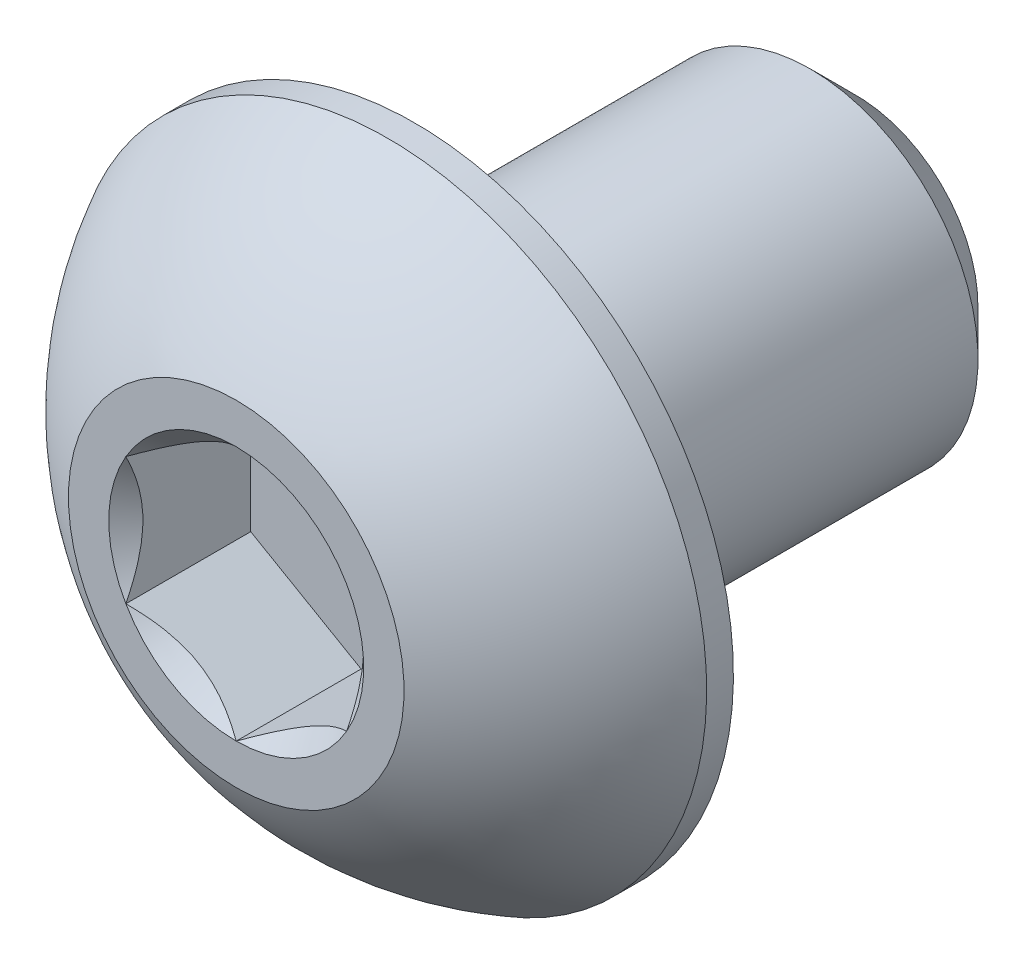
ISO-10303-21;
HEADER;
FILE_DESCRIPTION(('STEP AP214'),'2;1');
FILE_NAME('part.step','',(''),(''),'','','');
FILE_SCHEMA(('AUTOMOTIVE_DESIGN { 1 0 10303 214 1 1 1 1 }'));
ENDSEC;
DATA;
#1=APPLICATION_CONTEXT('core data for automotive mechanical design processes');
#2=APPLICATION_PROTOCOL_DEFINITION('international standard','automotive_design',2000,#1);
#3=PRODUCT_CONTEXT('',#1,'mechanical');
#4=PRODUCT('Part','Part','',(#3));
#5=PRODUCT_RELATED_PRODUCT_CATEGORY('part','',(#4));
#6=PRODUCT_DEFINITION_FORMATION('','',#4);
#7=PRODUCT_DEFINITION_CONTEXT('part definition',#1,'design');
#8=PRODUCT_DEFINITION('design','',#6,#7);
#9=PRODUCT_DEFINITION_SHAPE('','',#8);
#10=(LENGTH_UNIT() NAMED_UNIT(*) SI_UNIT(.MILLI.,.METRE.));
#11=(NAMED_UNIT(*) PLANE_ANGLE_UNIT() SI_UNIT($,.RADIAN.));
#12=(NAMED_UNIT(*) SI_UNIT($,.STERADIAN.) SOLID_ANGLE_UNIT());
#13=UNCERTAINTY_MEASURE_WITH_UNIT(LENGTH_MEASURE(1.E-05),#10,'distance_accuracy_value','');
#14=(GEOMETRIC_REPRESENTATION_CONTEXT(3) GLOBAL_UNCERTAINTY_ASSIGNED_CONTEXT((#13)) GLOBAL_UNIT_ASSIGNED_CONTEXT((#10,
#11,#12)) REPRESENTATION_CONTEXT('',''));
#15=CARTESIAN_POINT('',(0.,0.,0.));
#16=DIRECTION('',(0.,0.,1.));
#17=DIRECTION('',(1.,0.,0.));
#18=AXIS2_PLACEMENT_3D('',#15,#16,#17);
#19=CARTESIAN_POINT('',(0.,0.,-0.117180614443801));
#20=DIRECTION('',(0.,0.,1.));
#21=DIRECTION('',(0.,-1.,0.));
#22=AXIS2_PLACEMENT_3D('',#19,#20,#21);
#23=SPHERICAL_SURFACE('',#22,5.17224338526462);
#24=CARTESIAN_POINT('',(0.,0.,4.4577));
#25=DIRECTION('',(0.,0.,1.));
#26=DIRECTION('',(0.,-1.,0.));
#27=AXIS2_PLACEMENT_3D('',#24,#25,#26);
#28=CIRCLE('',#27,2.41299999999999);
#29=CARTESIAN_POINT('',(0.,-2.41299999999999,4.4577));
#30=VERTEX_POINT('',#29);
#31=EDGE_CURVE('E12',#30,#30,#28,.T.);
#32=CARTESIAN_POINT('',(0.,0.,2.27711));
#33=DIRECTION('',(0.,0.,1.));
#34=DIRECTION('',(0.,-1.,0.));
#35=AXIS2_PLACEMENT_3D('',#32,#33,#34);
#36=CIRCLE('',#35,4.58469999999999);
#37=CARTESIAN_POINT('',(0.,-4.5847,2.27711));
#38=VERTEX_POINT('',#37);
#39=EDGE_CURVE('E199',#38,#38,#36,.T.);
#40=CARTESIAN_POINT('',(0.,-2.41299999999999,4.4577));
#41=CARTESIAN_POINT('',(0.,-2.44179113663082,4.4425142902212));
#42=CARTESIAN_POINT('',(0.,-2.47043888331473,4.42705672580666));
#43=CARTESIAN_POINT('',(0.,-2.5274374690351,4.39560354866306));
#44=CARTESIAN_POINT('',(0.,-2.55578830807154,4.37960793593398));
#45=CARTESIAN_POINT('',(0.,-2.6121829507433,4.34708432311823));
#46=CARTESIAN_POINT('',(0.,-2.64022675437862,4.33055632303154));
#47=CARTESIAN_POINT('',(0.,-2.69599733629137,4.29697383760983));
#48=CARTESIAN_POINT('',(0.,-2.72372411456882,4.27991935227481));
#49=CARTESIAN_POINT('',(0.,-2.77885076121154,4.24528997235706));
#50=CARTESIAN_POINT('',(0.,-2.80625062957681,4.22771507777433));
#51=CARTESIAN_POINT('',(0.,-2.86071369040081,4.19205114454625));
#52=CARTESIAN_POINT('',(0.,-2.88777688285953,4.1739621059009));
#53=CARTESIAN_POINT('',(0.,-2.94155694533545,4.13727633200587));
#54=CARTESIAN_POINT('',(0.,-2.96827381535265,4.11867959675619));
#55=CARTESIAN_POINT('',(0.,-3.02135171000008,4.08098505833935));
#56=CARTESIAN_POINT('',(0.,-3.04771273463032,4.06188725517219));
#57=CARTESIAN_POINT('',(0.,-3.10006954235698,4.02319738813719));
#58=CARTESIAN_POINT('',(0.,-3.1260653254534,4.00360532426935));
#59=CARTESIAN_POINT('',(0.,-3.17768238416295,3.9639339192434));
#60=CARTESIAN_POINT('',(0.,-3.20330365977609,3.94385457808527));
#61=CARTESIAN_POINT('',(0.,-3.25416257105644,3.90321577556943));
#62=CARTESIAN_POINT('',(0.,-3.27940020672366,3.8826563142117));
#63=CARTESIAN_POINT('',(0.,-3.32948284239517,3.84106459952302));
#64=CARTESIAN_POINT('',(0.,-3.35432784239945,3.82003234619207));
#65=CARTESIAN_POINT('',(0.,-3.40361635097913,3.77750254430517));
#66=CARTESIAN_POINT('',(0.,-3.42805985955452,3.75600499574923));
#67=CARTESIAN_POINT('',(0.,-3.47653667261835,3.71255226601078));
#68=CARTESIAN_POINT('',(0.,-3.5005699771068,3.69059708482828));
#69=CARTESIAN_POINT('',(0.,-3.54821781555202,3.64623691555397));
#70=CARTESIAN_POINT('',(0.,-3.57183234950881,3.62383192746216));
#71=CARTESIAN_POINT('',(0.,-3.61863422971283,3.57858013041589));
#72=CARTESIAN_POINT('',(0.,-3.64182157596007,3.55573332146145));
#73=CARTESIAN_POINT('',(0.,-3.68776081583415,3.50960602621947));
#74=CARTESIAN_POINT('',(0.,-3.71051270946098,3.48632553993194));
#75=CARTESIAN_POINT('',(0.,-3.75557293439635,3.43933918813355));
#76=CARTESIAN_POINT('',(0.,-3.77788126570489,3.4156333226227));
#77=CARTESIAN_POINT('',(0.,-3.8220464144094,3.36780466210982));
#78=CARTESIAN_POINT('',(0.,-3.84390323180538,3.34368186710779));
#79=CARTESIAN_POINT('',(0.,-3.88715756202835,3.29502794595533));
#80=CARTESIAN_POINT('',(0.,-3.90855507485535,3.27049681980489));
#81=CARTESIAN_POINT('',(0.,-3.95088316899875,3.22103498024412));
#82=CARTESIAN_POINT('',(0.,-3.97181375031514,3.19610426683378));
#83=CARTESIAN_POINT('',(0.,-4.01320052092911,3.14585213907091));
#84=CARTESIAN_POINT('',(0.,-4.03365671022668,3.12053072471837));
#85=CARTESIAN_POINT('',(0.,-4.07408740538699,3.06950622065024));
#86=CARTESIAN_POINT('',(0.,-4.09406191124972,3.04380313093464));
#87=CARTESIAN_POINT('',(0.,-4.13352211981721,2.99202443776487));
#88=CARTESIAN_POINT('',(0.,-4.15300782252198,2.9659488343107));
#89=CARTESIAN_POINT('',(0.,-4.19148347927457,2.91343440806449));
#90=CARTESIAN_POINT('',(0.,-4.21047343332239,2.88699558527244));
#91=CARTESIAN_POINT('',(0.,-4.24795082398615,2.8337641442277));
#92=CARTESIAN_POINT('',(0.,-4.26643826060207,2.80697152597501));
#93=CARTESIAN_POINT('',(0.,-4.3029040266735,2.75304204395437));
#94=CARTESIAN_POINT('',(0.,-4.32088235612901,2.72590518018642));
#95=CARTESIAN_POINT('',(0.,-4.35632349988304,2.67129687992885));
#96=CARTESIAN_POINT('',(0.,-4.37378631418156,2.64382544343921));
#97=CARTESIAN_POINT('',(0.,-4.40819020238473,2.58855778924562));
#98=CARTESIAN_POINT('',(0.,-4.42513127628938,2.56076157154166));
#99=CARTESIAN_POINT('',(0.,-4.45848564813517,2.50485426421283));
#100=CARTESIAN_POINT('',(0.,-4.4748989460763,2.47674317458796));
#101=CARTESIAN_POINT('',(0.,-4.50719190474586,2.42021613740194));
#102=CARTESIAN_POINT('',(0.,-4.5230715654743,2.39180018984077));
#103=CARTESIAN_POINT('',(0.,-4.55429163018257,2.33467358757738));
#104=CARTESIAN_POINT('',(0.,-4.56963203416241,2.30596293287515));
#105=CARTESIAN_POINT('',(0.,-4.5847,2.27711));
#106=B_SPLINE_CURVE_WITH_KNOTS('',3,(#40,#41,#42,#43,#44,#45,#46,#47,#48,#49,#50,#51,#52,#53,
#54,#55,#56,#57,#58,#59,#60,#61,#62,#63,#64,#65,#66,#67,#68,#69,#70,#71,#72,#73,#74,#75,#76,#77,
#78,#79,#80,#81,#82,#83,#84,#85,#86,#87,#88,#89,#90,#91,#92,#93,#94,#95,#96,#97,#98,#99,#100,
#101,#102,#103,#104,#105),.UNSPECIFIED.,.F.,.F.,(4,2,2,2,2,2,2,2,2,2,2,2,2,2,2,2,2,2,2,2,2,2,2,
2,2,2,2,2,2,2,2,2,4),(0.,0.0976500604051489,0.195300120810298,0.292950181215448,
0.390600241620597,0.488250302025746,0.585900362430896,0.683550422836045,0.781200483241195,
0.878850543646344,0.976500604051493,1.07415066445664,1.17180072486179,1.26945078526694,
1.36710084567209,1.46475090607724,1.56240096648239,1.66005102688754,1.75770108729269,
1.85535114769784,1.95300120810299,2.05065126850814,2.14830132891329,2.24595138931844,
2.34360144972358,2.44125151012873,2.53890157053388,2.63655163093903,2.73420169134418,
2.83185175174933,2.92950181215448,3.02715187255963,3.12480193296478),.UNSPECIFIED.);
#107=EDGE_CURVE('BSEAM48',#30,#38,#106,.T.);
#108=ORIENTED_EDGE('',*,*,#31,.F.);
#109=ORIENTED_EDGE('',*,*,#39,.T.);
#110=ORIENTED_EDGE('',*,*,#107,.T.);
#111=ORIENTED_EDGE('',*,*,#107,.F.);
#112=EDGE_LOOP('',(#108,#110,#109,#111));
#113=FACE_BOUND('',#112,.T.);
#114=ADVANCED_FACE('F48',(#113),#23,.T.);
#115=CARTESIAN_POINT('',(0.,-2.413,4.4577));
#116=DIRECTION('',(0.,0.,-1.));
#117=DIRECTION('',(0.,1.,0.));
#118=AXIS2_PLACEMENT_3D('',#115,#116,#117);
#119=PLANE('',#118);
#120=CARTESIAN_POINT('',(0.,0.,4.4577));
#121=DIRECTION('',(0.,0.,1.));
#122=DIRECTION('',(1.,0.,0.));
#123=AXIS2_PLACEMENT_3D('',#120,#121,#122);
#124=CIRCLE('',#123,1.83308710467706);
#125=CARTESIAN_POINT('',(0.,1.83308710467706,4.4577));
#126=VERTEX_POINT('',#125);
#127=CARTESIAN_POINT('',(-1.5875,0.916543552338525,4.4577));
#128=VERTEX_POINT('',#127);
#129=EDGE_CURVE('E151',#126,#128,#124,.T.);
#130=ORIENTED_EDGE('',*,*,#129,.F.);
#131=CARTESIAN_POINT('',(1.5875,0.916543552338528,4.4577));
#132=VERTEX_POINT('',#131);
#133=EDGE_CURVE('E122',#132,#126,#124,.T.);
#134=ORIENTED_EDGE('',*,*,#133,.F.);
#135=CARTESIAN_POINT('',(1.5875,-0.916543552338527,4.4577));
#136=VERTEX_POINT('',#135);
#137=EDGE_CURVE('E110',#136,#132,#124,.T.);
#138=ORIENTED_EDGE('',*,*,#137,.F.);
#139=CARTESIAN_POINT('',(0.,-1.83308710467706,4.4577));
#140=VERTEX_POINT('',#139);
#141=EDGE_CURVE('E101',#140,#136,#124,.T.);
#142=ORIENTED_EDGE('',*,*,#141,.F.);
#143=CARTESIAN_POINT('',(-1.5875,-0.916543552338533,4.4577));
#144=VERTEX_POINT('',#143);
#145=EDGE_CURVE('E62',#144,#140,#124,.T.);
#146=ORIENTED_EDGE('',*,*,#145,.F.);
#147=EDGE_CURVE('E69',#128,#144,#124,.T.);
#148=ORIENTED_EDGE('',*,*,#147,.F.);
#149=EDGE_LOOP('',(#130,#134,#138,#142,#146,#148));
#150=FACE_BOUND('',#149,.T.);
#151=ORIENTED_EDGE('',*,*,#31,.T.);
#152=EDGE_LOOP('',(#151));
#153=FACE_BOUND('',#152,.T.);
#154=ADVANCED_FACE('F145',(#150,#153),#119,.F.);
#155=CARTESIAN_POINT('',(0.,-4.5847,1.8923));
#156=DIRECTION('',(0.,0.,1.));
#157=DIRECTION('',(0.,-1.,0.));
#158=AXIS2_PLACEMENT_3D('',#155,#156,#157);
#159=PLANE('',#158);
#160=CARTESIAN_POINT('',(0.,0.,1.8923));
#161=DIRECTION('',(0.,0.,1.));
#162=DIRECTION('',(0.,-1.,0.));
#163=AXIS2_PLACEMENT_3D('',#160,#161,#162);
#164=CIRCLE('',#163,4.58469999999999);
#165=CARTESIAN_POINT('',(0.,-4.5847,1.8923));
#166=VERTEX_POINT('',#165);
#167=EDGE_CURVE('E56',#166,#166,#164,.T.);
#168=ORIENTED_EDGE('',*,*,#167,.F.);
#169=EDGE_LOOP('',(#168));
#170=FACE_BOUND('',#169,.T.);
#171=ADVANCED_FACE('F209',(#170),#159,.F.);
#172=CARTESIAN_POINT('',(0.,0.,4.4577));
#173=DIRECTION('',(0.,0.,1.));
#174=DIRECTION('',(0.,-1.,0.));
#175=AXIS2_PLACEMENT_3D('',#172,#173,#174);
#176=CYLINDRICAL_SURFACE('',#175,4.58469999999999);
#177=ORIENTED_EDGE('',*,*,#39,.F.);
#178=EDGE_LOOP('',(#177));
#179=FACE_BOUND('',#178,.T.);
#180=ORIENTED_EDGE('',*,*,#167,.T.);
#181=EDGE_LOOP('',(#180));
#182=FACE_BOUND('',#181,.T.);
#183=ADVANCED_FACE('F207',(#179,#182),#176,.T.);
#184=CARTESIAN_POINT('',(0.,0.,4.4577));
#185=DIRECTION('',(0.,0.,1.));
#186=DIRECTION('',(1.,0.,0.));
#187=AXIS2_PLACEMENT_3D('',#184,#185,#186);
#188=CONICAL_SURFACE('',#187,1.83308710467706,0.78539816339745);
#189=ORIENTED_EDGE('',*,*,#137,.T.);
#190=CARTESIAN_POINT('',(1.5875,-1.83163614232865,5.04846256225457));
#191=CARTESIAN_POINT('',(1.5875,-1.78705354844902,5.01477785480324));
#192=CARTESIAN_POINT('',(1.5875,-1.74222294150555,4.98142232996863));
#193=CARTESIAN_POINT('',(1.5875,-1.65196486784505,4.91550567588829));
#194=CARTESIAN_POINT('',(1.5875,-1.60653725449665,4.88294474763447));
#195=CARTESIAN_POINT('',(1.5875,-1.46854281940083,4.78619344946124));
#196=CARTESIAN_POINT('',(1.5875,-1.37494211623386,4.72345326461286));
#197=CARTESIAN_POINT('',(1.5875,-1.17864136265695,4.60025315129465));
#198=CARTESIAN_POINT('',(1.5875,-1.07572731596385,4.54013032892265));
#199=CARTESIAN_POINT('',(1.5875,-0.864754189558118,4.43012936655099));
#200=CARTESIAN_POINT('',(1.5875,-0.756714033301438,4.38021668506233));
#201=CARTESIAN_POINT('',(1.5875,-0.594580029688666,4.31915203624882));
#202=CARTESIAN_POINT('',(1.5875,-0.542894373932897,4.30163220249743));
#203=CARTESIAN_POINT('',(1.5875,-0.43827206291756,4.27074157984305));
#204=CARTESIAN_POINT('',(1.5875,-0.3853353220534,4.25737107574461));
#205=CARTESIAN_POINT('',(1.5875,-0.279413400734369,4.23569731895543));
#206=CARTESIAN_POINT('',(1.5875,-0.226446313904206,4.22730702319986));
#207=CARTESIAN_POINT('',(1.5875,-0.119941637592404,4.21575808898768));
#208=CARTESIAN_POINT('',(1.5875,-0.066404148626323,4.21259854363344));
#209=CARTESIAN_POINT('',(1.5875,0.0387581192420282,4.21174701703488));
#210=CARTESIAN_POINT('',(1.5875,0.0903813815542162,4.21385966539149));
#211=CARTESIAN_POINT('',(1.5875,0.19318730201683,4.22300415332194));
#212=CARTESIAN_POINT('',(1.5875,0.244369916988517,4.2300364695398));
#213=CARTESIAN_POINT('',(1.5875,0.346790527788957,4.24875505064483));
#214=CARTESIAN_POINT('',(1.5875,0.39801380417214,4.26052064135902));
#215=CARTESIAN_POINT('',(1.5875,0.499340680307277,4.28807934285079));
#216=CARTESIAN_POINT('',(1.5875,0.549444372105895,4.30387212119818));
#217=CARTESIAN_POINT('',(1.5875,0.707022639586408,4.35948662092826));
#218=CARTESIAN_POINT('',(1.5875,0.812258737570579,4.40563523273466));
#219=CARTESIAN_POINT('',(1.5875,1.01778869013701,4.50824584038088));
#220=CARTESIAN_POINT('',(1.5875,1.11806310933257,4.56474485510755));
#221=CARTESIAN_POINT('',(1.5875,1.30970442577157,4.68131250297262));
#222=CARTESIAN_POINT('',(1.5875,1.40126637149297,4.74106444197861));
#223=CARTESIAN_POINT('',(1.5875,1.53616443073865,4.83343700869171));
#224=CARTESIAN_POINT('',(1.5875,1.58054835823549,4.86455401427473));
#225=CARTESIAN_POINT('',(1.5875,1.66870952512132,4.92761155018117));
#226=CARTESIAN_POINT('',(1.5875,1.71248692801697,4.95955185164746));
#227=CARTESIAN_POINT('',(1.5875,1.75601179240957,4.99183355784713));
#228=B_SPLINE_CURVE_WITH_KNOTS('',3,(#190,#191,#192,#193,#194,#195,#196,#197,#198,#199,#200,
#201,#202,#203,#204,#205,#206,#207,#208,#209,#210,#211,#212,#213,#214,#215,#216,#217,#218,#219,
#220,#221,#222,#223,#224,#225,#226,#227),.UNSPECIFIED.,.F.,.F.,(4,2,2,2,2,2,2,2,2,2,2,2,2,2,2,2,
2,2,4),(0.,0.167627505127548,0.33529698084648,0.673194674702939,1.0304700708717,
1.38651603079307,1.55010049300858,1.71369618096554,1.87434127467533,2.034958513124,
2.18971280484453,2.34448209207484,2.50196108385089,2.6594270804953,3.00314617711216,
3.34811949873715,3.6759579216973,3.83856722085481,4.00113179576279),.UNSPECIFIED.);
#229=EDGE_CURVE('E115',#136,#132,#228,.T.);
#230=ORIENTED_EDGE('',*,*,#229,.F.);
#231=EDGE_LOOP('',(#189,#230));
#232=FACE_BOUND('',#231,.T.);
#233=ADVANCED_FACE('F116',(#232),#188,.F.);
#234=ORIENTED_EDGE('',*,*,#133,.T.);
#235=CARTESIAN_POINT('',(1.5877,0.916428082284688,4.4578154809637));
#236=CARTESIAN_POINT('',(1.53312479190086,0.947937093371804,4.42633080837059));
#237=CARTESIAN_POINT('',(1.47763696320971,0.97997300620339,4.39669504601353));
#238=CARTESIAN_POINT('',(1.36449087915364,1.04529792829091,4.34243226002082));
#239=CARTESIAN_POINT('',(1.30682185887062,1.07859315267522,4.31783543513317));
#240=CARTESIAN_POINT('',(1.1905349781269,1.14573141457583,4.27570036427258));
#241=CARTESIAN_POINT('',(1.13194674474407,1.17955734689075,4.25805619272982));
#242=CARTESIAN_POINT('',(1.01348022674557,1.24795402294714,4.23087147008496));
#243=CARTESIAN_POINT('',(0.953605562983894,1.28252267618758,4.22131062069507));
#244=CARTESIAN_POINT('',(0.850418771876556,1.34209759781022,4.212684413104));
#245=CARTESIAN_POINT('',(0.807240015952287,1.36702686416637,4.21140719280957));
#246=CARTESIAN_POINT('',(0.720953038535398,1.41684467380557,4.2135570558147));
#247=CARTESIAN_POINT('',(0.677844847078611,1.44173319974742,4.21698578854934));
#248=CARTESIAN_POINT('',(0.59204633500203,1.4912689937909,4.22835099443334));
#249=CARTESIAN_POINT('',(0.549356408925406,1.51591603410293,4.23629137180164));
#250=CARTESIAN_POINT('',(0.464693063478358,1.56479643938728,4.2562484144511));
#251=CARTESIAN_POINT('',(0.422719959755074,1.58902962212064,4.26826682920869));
#252=CARTESIAN_POINT('',(0.315211458113566,1.65109968448354,4.30394689724724));
#253=CARTESIAN_POINT('',(0.2503427717089,1.68855163804125,4.33029857230313));
#254=CARTESIAN_POINT('',(0.154961599380924,1.74361998356042,4.3747835368517));
#255=CARTESIAN_POINT('',(0.123530699536157,1.76176662204667,4.39041285780113));
#256=CARTESIAN_POINT('',(0.0612469855696372,1.79772614107137,4.4230984878611));
#257=CARTESIAN_POINT('',(0.0303939039605766,1.81553917604369,4.44015411565696));
#258=CARTESIAN_POINT('',(-0.000200000000000155,1.83320257473089,4.4578154809637));
#259=B_SPLINE_CURVE_WITH_KNOTS('',3,(#235,#236,#237,#238,#239,#240,#241,#242,#243,#244,#245,
#246,#247,#248,#249,#250,#251,#252,#253,#254,#255,#256,#257,#258),.UNSPECIFIED.,.F.,.F.,(4,2,2,
2,2,2,2,2,2,2,2,4),(0.,0.211482650810817,0.424197870807277,0.633533884524818,0.842342653263351,
0.991755553727144,1.14122083674205,1.29081565918877,1.44047473906438,1.6781878086972,
1.79671410024894,1.91518409436631),.UNSPECIFIED.);
#260=EDGE_CURVE('E121',#132,#126,#259,.T.);
#261=ORIENTED_EDGE('',*,*,#260,.F.);
#262=EDGE_LOOP('',(#234,#261));
#263=FACE_BOUND('',#262,.T.);
#264=ADVANCED_FACE('F309',(#263),#188,.F.);
#265=ORIENTED_EDGE('',*,*,#129,.T.);
#266=CARTESIAN_POINT('',(0.00019999999999999,1.83320257473089,4.4578154809637));
#267=CARTESIAN_POINT('',(-0.0543752080991361,1.80169356364378,4.42633080837059));
#268=CARTESIAN_POINT('',(-0.109863036790289,1.76965765081219,4.39669504601352));
#269=CARTESIAN_POINT('',(-0.223009120846358,1.70433272872467,4.34243226002082));
#270=CARTESIAN_POINT('',(-0.28067814112938,1.67103750434037,4.31783543513317));
#271=CARTESIAN_POINT('',(-0.396965021873102,1.60389924243976,4.27570036427258));
#272=CARTESIAN_POINT('',(-0.45555325525593,1.57007331012484,4.25805619272982));
#273=CARTESIAN_POINT('',(-0.574019773254429,1.50167663406844,4.23087147008496));
#274=CARTESIAN_POINT('',(-0.633894437016103,1.467107980828,4.22131062069507));
#275=CARTESIAN_POINT('',(-0.73708122812344,1.40753305920537,4.212684413104));
#276=CARTESIAN_POINT('',(-0.78025998404771,1.38260379284922,4.21140719280957));
#277=CARTESIAN_POINT('',(-0.866546961464598,1.33278598321002,4.2135570558147));
#278=CARTESIAN_POINT('',(-0.909655152921385,1.30789745726816,4.21698578854934));
#279=CARTESIAN_POINT('',(-0.995453664997966,1.25836166322468,4.22835099443334));
#280=CARTESIAN_POINT('',(-1.03814359107459,1.23371462291266,4.23629137180164));
#281=CARTESIAN_POINT('',(-1.12280693652164,1.18483421762831,4.2562484144511));
#282=CARTESIAN_POINT('',(-1.16478004024492,1.16060103489495,4.26826682920869));
#283=CARTESIAN_POINT('',(-1.27228854188643,1.09853097253205,4.30394689724724));
#284=CARTESIAN_POINT('',(-1.3371572282911,1.06107901897434,4.33029857230313));
#285=CARTESIAN_POINT('',(-1.43253840061907,1.00601067345516,4.3747835368517));
#286=CARTESIAN_POINT('',(-1.46396930046384,0.98786403496891,4.39041285780113));
#287=CARTESIAN_POINT('',(-1.52625301443036,0.95190451594421,4.4230984878611));
#288=CARTESIAN_POINT('',(-1.55710609603942,0.93409148097189,4.44015411565697));
#289=CARTESIAN_POINT('',(-1.5877,0.916428082284689,4.4578154809637));
#290=B_SPLINE_CURVE_WITH_KNOTS('',3,(#266,#267,#268,#269,#270,#271,#272,#273,#274,#275,#276,
#277,#278,#279,#280,#281,#282,#283,#284,#285,#286,#287,#288,#289),.UNSPECIFIED.,.F.,.F.,(4,2,2,
2,2,2,2,2,2,2,2,4),(0.,0.211482650810815,0.424197870807274,0.633533884524813,0.842342653263345,
0.991755553727138,1.14122083674204,1.29081565918877,1.44047473906437,1.6781878086972,
1.79671410024894,1.91518409436631),.UNSPECIFIED.);
#291=EDGE_CURVE('E165',#126,#128,#290,.T.);
#292=ORIENTED_EDGE('',*,*,#291,.F.);
#293=EDGE_LOOP('',(#265,#292));
#294=FACE_BOUND('',#293,.T.);
#295=ADVANCED_FACE('F163',(#294),#188,.F.);
#296=ORIENTED_EDGE('',*,*,#147,.T.);
#297=CARTESIAN_POINT('',(-1.5875,-1.83163614232866,5.04846256225457));
#298=CARTESIAN_POINT('',(-1.5875,-1.78705354844903,5.01477785480324));
#299=CARTESIAN_POINT('',(-1.5875,-1.74222294150556,4.98142232996863));
#300=CARTESIAN_POINT('',(-1.5875,-1.65196486784505,4.91550567588829));
#301=CARTESIAN_POINT('',(-1.5875,-1.60653725449665,4.88294474763447));
#302=CARTESIAN_POINT('',(-1.5875,-1.46854281940083,4.78619344946124));
#303=CARTESIAN_POINT('',(-1.5875,-1.37494211623386,4.72345326461286));
#304=CARTESIAN_POINT('',(-1.5875,-1.17864136265695,4.60025315129465));
#305=CARTESIAN_POINT('',(-1.5875,-1.07572731596385,4.54013032892265));
#306=CARTESIAN_POINT('',(-1.5875,-0.864754189558122,4.43012936655099));
#307=CARTESIAN_POINT('',(-1.5875,-0.756714033301443,4.38021668506233));
#308=CARTESIAN_POINT('',(-1.5875,-0.59458002968867,4.31915203624881));
#309=CARTESIAN_POINT('',(-1.5875,-0.542894373932902,4.30163220249743));
#310=CARTESIAN_POINT('',(-1.5875,-0.438272062917564,4.27074157984304));
#311=CARTESIAN_POINT('',(-1.5875,-0.385335322053404,4.25737107574461));
#312=CARTESIAN_POINT('',(-1.5875,-0.279413400734373,4.23569731895543));
#313=CARTESIAN_POINT('',(-1.5875,-0.22644631390421,4.22730702319986));
#314=CARTESIAN_POINT('',(-1.5875,-0.119941637592407,4.21575808898768));
#315=CARTESIAN_POINT('',(-1.5875,-0.0664041486263263,4.21259854363344));
#316=CARTESIAN_POINT('',(-1.5875,0.0387581192420254,4.21174701703488));
#317=CARTESIAN_POINT('',(-1.5875,0.0903813815542137,4.21385966539149));
#318=CARTESIAN_POINT('',(-1.5875,0.193187302016827,4.22300415332193));
#319=CARTESIAN_POINT('',(-1.5875,0.244369916988515,4.2300364695398));
#320=CARTESIAN_POINT('',(-1.5875,0.346790527788954,4.24875505064483));
#321=CARTESIAN_POINT('',(-1.5875,0.398013804172138,4.26052064135902));
#322=CARTESIAN_POINT('',(-1.5875,0.499340680307275,4.28807934285078));
#323=CARTESIAN_POINT('',(-1.5875,0.549444372105893,4.30387212119817));
#324=CARTESIAN_POINT('',(-1.5875,0.707022639586406,4.35948662092826));
#325=CARTESIAN_POINT('',(-1.5875,0.812258737570576,4.40563523273466));
#326=CARTESIAN_POINT('',(-1.5875,1.017788690137,4.50824584038088));
#327=CARTESIAN_POINT('',(-1.5875,1.11806310933256,4.56474485510755));
#328=CARTESIAN_POINT('',(-1.5875,1.30970442577157,4.68131250297261));
#329=CARTESIAN_POINT('',(-1.5875,1.40126637149297,4.74106444197861));
#330=CARTESIAN_POINT('',(-1.5875,1.53616443073864,4.8334370086917));
#331=CARTESIAN_POINT('',(-1.5875,1.58054835823549,4.86455401427472));
#332=CARTESIAN_POINT('',(-1.5875,1.66870952512132,4.92761155018116));
#333=CARTESIAN_POINT('',(-1.5875,1.71248692801697,4.95955185164746));
#334=CARTESIAN_POINT('',(-1.5875,1.75601179240957,4.99183355784712));
#335=B_SPLINE_CURVE_WITH_KNOTS('',3,(#297,#298,#299,#300,#301,#302,#303,#304,#305,#306,#307,
#308,#309,#310,#311,#312,#313,#314,#315,#316,#317,#318,#319,#320,#321,#322,#323,#324,#325,#326,
#327,#328,#329,#330,#331,#332,#333,#334),.UNSPECIFIED.,.F.,.F.,(4,2,2,2,2,2,2,2,2,2,2,2,2,2,2,2,
2,2,4),(0.,0.167627505127548,0.335296980846481,0.673194674702942,1.03047007087171,
1.38651603079308,1.55010049300858,1.71369618096555,1.87434127467534,2.03495851312401,
2.18971280484454,2.34448209207485,2.5019610838509,2.6594270804953,3.00314617711217,
3.34811949873715,3.6759579216973,3.83856722085481,4.0011317957628),.UNSPECIFIED.);
#336=EDGE_CURVE('E167',#128,#144,#335,.F.);
#337=ORIENTED_EDGE('',*,*,#336,.F.);
#338=EDGE_LOOP('',(#296,#337));
#339=FACE_BOUND('',#338,.T.);
#340=ADVANCED_FACE('F168',(#339),#188,.F.);
#341=ORIENTED_EDGE('',*,*,#145,.T.);
#342=CARTESIAN_POINT('',(-1.5877,-0.916428082284698,4.45781548096371));
#343=CARTESIAN_POINT('',(-1.53312479190086,-0.947937093371814,4.4263308083706));
#344=CARTESIAN_POINT('',(-1.47763696320971,-0.979973006203399,4.39669504601353));
#345=CARTESIAN_POINT('',(-1.36449087915364,-1.04529792829092,4.34243226002083));
#346=CARTESIAN_POINT('',(-1.30682185887062,-1.07859315267523,4.31783543513318));
#347=CARTESIAN_POINT('',(-1.1905349781269,-1.14573141457584,4.27570036427258));
#348=CARTESIAN_POINT('',(-1.13194674474407,-1.17955734689076,4.25805619272982));
#349=CARTESIAN_POINT('',(-1.01348022674557,-1.24795402294715,4.23087147008497));
#350=CARTESIAN_POINT('',(-0.953605562983896,-1.28252267618759,4.22131062069508));
#351=CARTESIAN_POINT('',(-0.850418771876559,-1.34209759781022,4.21268441310401));
#352=CARTESIAN_POINT('',(-0.807240015952289,-1.36702686416637,4.21140719280958));
#353=CARTESIAN_POINT('',(-0.720953038535399,-1.41684467380557,4.21355705581471));
#354=CARTESIAN_POINT('',(-0.677844847078613,-1.44173319974743,4.21698578854935));
#355=CARTESIAN_POINT('',(-0.592046335002032,-1.49126899379091,4.22835099443335));
#356=CARTESIAN_POINT('',(-0.549356408925407,-1.51591603410294,4.23629137180165));
#357=CARTESIAN_POINT('',(-0.464693063478359,-1.56479643938728,4.2562484144511));
#358=CARTESIAN_POINT('',(-0.422719959755075,-1.58902962212065,4.26826682920869));
#359=CARTESIAN_POINT('',(-0.315211458113567,-1.65109968448354,4.30394689724725));
#360=CARTESIAN_POINT('',(-0.250342771708901,-1.68855163804125,4.33029857230314));
#361=CARTESIAN_POINT('',(-0.154961599380926,-1.74361998356043,4.37478353685171));
#362=CARTESIAN_POINT('',(-0.123530699536158,-1.76176662204668,4.39041285780113));
#363=CARTESIAN_POINT('',(-0.0612469855696383,-1.79772614107138,4.4230984878611));
#364=CARTESIAN_POINT('',(-0.0303939039605777,-1.8155391760437,4.44015411565697));
#365=CARTESIAN_POINT('',(0.000199999999998782,-1.8332025747309,4.45781548096371));
#366=B_SPLINE_CURVE_WITH_KNOTS('',3,(#342,#343,#344,#345,#346,#347,#348,#349,#350,#351,#352,
#353,#354,#355,#356,#357,#358,#359,#360,#361,#362,#363,#364,#365),.UNSPECIFIED.,.F.,.F.,(4,2,2,
2,2,2,2,2,2,2,2,4),(0.,0.211482650810815,0.424197870807274,0.633533884524812,0.842342653263344,
0.991755553727137,1.14122083674204,1.29081565918877,1.44047473906437,1.6781878086972,
1.79671410024894,1.91518409436631),.UNSPECIFIED.);
#367=EDGE_CURVE('E133',#144,#140,#366,.T.);
#368=ORIENTED_EDGE('',*,*,#367,.F.);
#369=EDGE_LOOP('',(#341,#368));
#370=FACE_BOUND('',#369,.T.);
#371=ADVANCED_FACE('F332',(#370),#188,.F.);
#372=ORIENTED_EDGE('',*,*,#141,.T.);
#373=CARTESIAN_POINT('',(-0.000200000000001129,-1.8332025747309,4.45781548096371));
#374=CARTESIAN_POINT('',(0.0543752080991355,-1.80169356364379,4.4263308083706));
#375=CARTESIAN_POINT('',(0.109863036790289,-1.7696576508122,4.39669504601353));
#376=CARTESIAN_POINT('',(0.223009120846358,-1.70433272872468,4.34243226002083));
#377=CARTESIAN_POINT('',(0.28067814112938,-1.67103750434037,4.31783543513318));
#378=CARTESIAN_POINT('',(0.396965021873103,-1.60389924243976,4.27570036427258));
#379=CARTESIAN_POINT('',(0.455553255255931,-1.57007331012484,4.25805619272982));
#380=CARTESIAN_POINT('',(0.574019773254431,-1.50167663406845,4.23087147008497));
#381=CARTESIAN_POINT('',(0.633894437016105,-1.46710798082801,4.22131062069508));
#382=CARTESIAN_POINT('',(0.737081228123443,-1.40753305920537,4.21268441310401));
#383=CARTESIAN_POINT('',(0.780259984047713,-1.38260379284922,4.21140719280958));
#384=CARTESIAN_POINT('',(0.866546961464602,-1.33278598321002,4.21355705581471));
#385=CARTESIAN_POINT('',(0.909655152921389,-1.30789745726817,4.21698578854935));
#386=CARTESIAN_POINT('',(0.99545366499797,-1.25836166322469,4.22835099443335));
#387=CARTESIAN_POINT('',(1.03814359107459,-1.23371462291266,4.23629137180164));
#388=CARTESIAN_POINT('',(1.12280693652164,-1.18483421762831,4.2562484144511));
#389=CARTESIAN_POINT('',(1.16478004024493,-1.16060103489495,4.26826682920869));
#390=CARTESIAN_POINT('',(1.27228854188644,-1.09853097253205,4.30394689724725));
#391=CARTESIAN_POINT('',(1.3371572282911,-1.06107901897434,4.33029857230314));
#392=CARTESIAN_POINT('',(1.43253840061908,-1.00601067345516,4.3747835368517));
#393=CARTESIAN_POINT('',(1.46396930046384,-0.987864034968915,4.39041285780113));
#394=CARTESIAN_POINT('',(1.52625301443036,-0.951904515944215,4.4230984878611));
#395=CARTESIAN_POINT('',(1.55710609603942,-0.934091480971894,4.44015411565697));
#396=CARTESIAN_POINT('',(1.5877,-0.916428082284694,4.45781548096371));
#397=B_SPLINE_CURVE_WITH_KNOTS('',3,(#373,#374,#375,#376,#377,#378,#379,#380,#381,#382,#383,
#384,#385,#386,#387,#388,#389,#390,#391,#392,#393,#394,#395,#396),.UNSPECIFIED.,.F.,.F.,(4,2,2,
2,2,2,2,2,2,2,2,4),(0.,0.211482650810817,0.424197870807277,0.633533884524818,0.842342653263351,
0.991755553727144,1.14122083674205,1.29081565918878,1.44047473906438,1.6781878086972,
1.79671410024894,1.91518409436631),.UNSPECIFIED.);
#398=EDGE_CURVE('E105',#140,#136,#397,.T.);
#399=ORIENTED_EDGE('',*,*,#398,.F.);
#400=EDGE_LOOP('',(#372,#399));
#401=FACE_BOUND('',#400,.T.);
#402=ADVANCED_FACE('F103',(#401),#188,.F.);
#403=CARTESIAN_POINT('',(1.5875,-0.916543552338532,2.66192));
#404=DIRECTION('',(0.,0.,1.));
#405=DIRECTION('',(1.,0.,0.));
#406=AXIS2_PLACEMENT_3D('',#403,#404,#405);
#407=PLANE('',#406);
#408=DIRECTION('',(0.866025403784438,0.5,0.));
#409=VECTOR('',#408,1.);
#410=CARTESIAN_POINT('',(0.,-1.83308710467706,2.66192));
#411=LINE('',#410,#409);
#412=CARTESIAN_POINT('',(0.,-1.83308710467706,2.66192));
#413=VERTEX_POINT('',#412);
#414=CARTESIAN_POINT('',(1.5875,-0.916543552338532,2.66192));
#415=VERTEX_POINT('',#414);
#416=EDGE_CURVE('E132',#413,#415,#411,.T.);
#417=ORIENTED_EDGE('',*,*,#416,.T.);
#418=DIRECTION('',(0.,1.,0.));
#419=VECTOR('',#418,1.);
#420=CARTESIAN_POINT('',(1.5875,-0.916543552338532,2.66192));
#421=LINE('',#420,#419);
#422=CARTESIAN_POINT('',(1.5875,0.916543552338526,2.66192));
#423=VERTEX_POINT('',#422);
#424=EDGE_CURVE('E137',#415,#423,#421,.T.);
#425=ORIENTED_EDGE('',*,*,#424,.T.);
#426=DIRECTION('',(-0.866025403784439,0.5,0.));
#427=VECTOR('',#426,1.);
#428=CARTESIAN_POINT('',(1.5875,0.916543552338526,2.66192));
#429=LINE('',#428,#427);
#430=CARTESIAN_POINT('',(0.,1.83308710467706,2.66192));
#431=VERTEX_POINT('',#430);
#432=EDGE_CURVE('E430',#423,#431,#429,.T.);
#433=ORIENTED_EDGE('',*,*,#432,.T.);
#434=DIRECTION('',(-0.866025403784439,-0.5,0.));
#435=VECTOR('',#434,1.);
#436=CARTESIAN_POINT('',(0.,1.83308710467706,2.66192));
#437=LINE('',#436,#435);
#438=CARTESIAN_POINT('',(-1.5875,0.916543552338527,2.66192));
#439=VERTEX_POINT('',#438);
#440=EDGE_CURVE('E434',#431,#439,#437,.T.);
#441=ORIENTED_EDGE('',*,*,#440,.T.);
#442=DIRECTION('',(0.,-1.,0.));
#443=VECTOR('',#442,1.);
#444=CARTESIAN_POINT('',(-1.5875,0.916543552338527,2.66192));
#445=LINE('',#444,#443);
#446=CARTESIAN_POINT('',(-1.5875,-0.916543552338536,2.66192));
#447=VERTEX_POINT('',#446);
#448=EDGE_CURVE('E185',#439,#447,#445,.T.);
#449=ORIENTED_EDGE('',*,*,#448,.T.);
#450=DIRECTION('',(0.866025403784438,-0.5,0.));
#451=VECTOR('',#450,1.);
#452=CARTESIAN_POINT('',(-1.5875,-0.916543552338536,2.66192));
#453=LINE('',#452,#451);
#454=EDGE_CURVE('E141',#447,#413,#453,.T.);
#455=ORIENTED_EDGE('',*,*,#454,.T.);
#456=EDGE_LOOP('',(#417,#425,#433,#441,#449,#455));
#457=FACE_BOUND('',#456,.T.);
#458=ADVANCED_FACE('F243',(#457),#407,.T.);
#459=CARTESIAN_POINT('',(1.5875,-0.916543552338532,2.66192));
#460=DIRECTION('',(1.,0.,0.));
#461=DIRECTION('',(0.,0.,-1.));
#462=AXIS2_PLACEMENT_3D('',#459,#460,#461);
#463=PLANE('',#462);
#464=DIRECTION('',(0.,0.,1.));
#465=VECTOR('',#464,1.);
#466=CARTESIAN_POINT('',(1.5875,-0.916543552338532,2.66192));
#467=LINE('',#466,#465);
#468=EDGE_CURVE('E128',#415,#136,#467,.T.);
#469=ORIENTED_EDGE('',*,*,#468,.T.);
#470=ORIENTED_EDGE('',*,*,#229,.T.);
#471=DIRECTION('',(0.,0.,1.));
#472=VECTOR('',#471,1.);
#473=CARTESIAN_POINT('',(1.5875,0.916543552338526,2.66192));
#474=LINE('',#473,#472);
#475=EDGE_CURVE('E140',#423,#132,#474,.T.);
#476=ORIENTED_EDGE('',*,*,#475,.F.);
#477=ORIENTED_EDGE('',*,*,#424,.F.);
#478=EDGE_LOOP('',(#469,#470,#476,#477));
#479=FACE_BOUND('',#478,.T.);
#480=ADVANCED_FACE('F135',(#479),#463,.F.);
#481=CARTESIAN_POINT('',(1.5875,0.916543552338526,2.66192));
#482=DIRECTION('',(0.5,0.866025403784439,0.));
#483=DIRECTION('',(-0.866025403784439,0.5,0.));
#484=AXIS2_PLACEMENT_3D('',#481,#482,#483);
#485=PLANE('',#484);
#486=ORIENTED_EDGE('',*,*,#475,.T.);
#487=ORIENTED_EDGE('',*,*,#260,.T.);
#488=DIRECTION('',(0.,0.,1.));
#489=VECTOR('',#488,1.);
#490=CARTESIAN_POINT('',(0.,1.83308710467706,2.66192));
#491=LINE('',#490,#489);
#492=EDGE_CURVE('E179',#431,#126,#491,.T.);
#493=ORIENTED_EDGE('',*,*,#492,.F.);
#494=ORIENTED_EDGE('',*,*,#432,.F.);
#495=EDGE_LOOP('',(#486,#487,#493,#494));
#496=FACE_BOUND('',#495,.T.);
#497=ADVANCED_FACE('F259',(#496),#485,.F.);
#498=CARTESIAN_POINT('',(0.,1.83308710467706,2.66192));
#499=DIRECTION('',(-0.5,0.866025403784439,0.));
#500=DIRECTION('',(-0.866025403784439,-0.5,0.));
#501=AXIS2_PLACEMENT_3D('',#498,#499,#500);
#502=PLANE('',#501);
#503=ORIENTED_EDGE('',*,*,#492,.T.);
#504=ORIENTED_EDGE('',*,*,#291,.T.);
#505=DIRECTION('',(0.,0.,1.));
#506=VECTOR('',#505,1.);
#507=CARTESIAN_POINT('',(-1.5875,0.916543552338527,2.66192));
#508=LINE('',#507,#506);
#509=EDGE_CURVE('E177',#439,#128,#508,.T.);
#510=ORIENTED_EDGE('',*,*,#509,.F.);
#511=ORIENTED_EDGE('',*,*,#440,.F.);
#512=EDGE_LOOP('',(#503,#504,#510,#511));
#513=FACE_BOUND('',#512,.T.);
#514=ADVANCED_FACE('F175',(#513),#502,.F.);
#515=CARTESIAN_POINT('',(-1.5875,0.916543552338527,2.66192));
#516=DIRECTION('',(-1.,0.,0.));
#517=DIRECTION('',(0.,-1.,0.));
#518=AXIS2_PLACEMENT_3D('',#515,#516,#517);
#519=PLANE('',#518);
#520=ORIENTED_EDGE('',*,*,#509,.T.);
#521=ORIENTED_EDGE('',*,*,#336,.T.);
#522=DIRECTION('',(0.,0.,1.));
#523=VECTOR('',#522,1.);
#524=CARTESIAN_POINT('',(-1.5875,-0.916543552338536,2.66192));
#525=LINE('',#524,#523);
#526=EDGE_CURVE('E188',#447,#144,#525,.T.);
#527=ORIENTED_EDGE('',*,*,#526,.F.);
#528=ORIENTED_EDGE('',*,*,#448,.F.);
#529=EDGE_LOOP('',(#520,#521,#527,#528));
#530=FACE_BOUND('',#529,.T.);
#531=ADVANCED_FACE('F183',(#530),#519,.F.);
#532=CARTESIAN_POINT('',(-1.5875,-0.916543552338536,2.66192));
#533=DIRECTION('',(-0.5,-0.866025403784439,0.));
#534=DIRECTION('',(0.866025403784439,-0.5,0.));
#535=AXIS2_PLACEMENT_3D('',#532,#533,#534);
#536=PLANE('',#535);
#537=ORIENTED_EDGE('',*,*,#526,.T.);
#538=ORIENTED_EDGE('',*,*,#367,.T.);
#539=DIRECTION('',(0.,0.,1.));
#540=VECTOR('',#539,1.);
#541=CARTESIAN_POINT('',(0.,-1.83308710467706,2.66192));
#542=LINE('',#541,#540);
#543=EDGE_CURVE('E130',#413,#140,#542,.T.);
#544=ORIENTED_EDGE('',*,*,#543,.F.);
#545=ORIENTED_EDGE('',*,*,#454,.F.);
#546=EDGE_LOOP('',(#537,#538,#544,#545));
#547=FACE_BOUND('',#546,.T.);
#548=ADVANCED_FACE('F285',(#547),#536,.F.);
#549=CARTESIAN_POINT('',(0.,-1.83308710467706,2.66192));
#550=DIRECTION('',(0.5,-0.866025403784438,0.));
#551=DIRECTION('',(0.866025403784438,0.5,0.));
#552=AXIS2_PLACEMENT_3D('',#549,#550,#551);
#553=PLANE('',#552);
#554=ORIENTED_EDGE('',*,*,#543,.T.);
#555=ORIENTED_EDGE('',*,*,#398,.T.);
#556=ORIENTED_EDGE('',*,*,#468,.F.);
#557=ORIENTED_EDGE('',*,*,#416,.F.);
#558=EDGE_LOOP('',(#554,#555,#556,#557));
#559=FACE_BOUND('',#558,.T.);
#560=ADVANCED_FACE('F126',(#559),#553,.F.);
#561=CLOSED_SHELL('',(#114,#154,#171,#183,#233,#264,#295,#340,#371,#402,#458,#480,#497,#514,
#531,#548,#560));
#562=MANIFOLD_SOLID_BREP('B2',#561);
#563=CARTESIAN_POINT('',(0.,2.413,-4.4577));
#564=DIRECTION('',(0.,0.,1.));
#565=DIRECTION('',(0.,-1.,0.));
#566=AXIS2_PLACEMENT_3D('',#563,#564,#565);
#567=PLANE('',#566);
#568=CARTESIAN_POINT('',(0.,0.,-4.4577));
#569=DIRECTION('',(0.,0.,1.));
#570=DIRECTION('',(0.,-1.,0.));
#571=AXIS2_PLACEMENT_3D('',#568,#569,#570);
#572=CIRCLE('',#571,1.75154166666666);
#573=CARTESIAN_POINT('',(0.,-1.75154166666666,-4.4577));
#574=VERTEX_POINT('',#573);
#575=EDGE_CURVE('E47',#574,#574,#572,.F.);
#576=ORIENTED_EDGE('',*,*,#575,.T.);
#577=EDGE_LOOP('',(#576));
#578=FACE_BOUND('',#577,.T.);
#579=ADVANCED_FACE('F466',(#578),#567,.F.);
#580=CARTESIAN_POINT('',(0.,0.,1.8923));
#581=DIRECTION('',(0.,0.,1.));
#582=DIRECTION('',(0.,-1.,0.));
#583=AXIS2_PLACEMENT_3D('',#580,#581,#582);
#584=CYLINDRICAL_SURFACE('',#583,2.413);
#585=CARTESIAN_POINT('',(0.,0.,-3.79624166666666));
#586=DIRECTION('',(0.,0.,1.));
#587=DIRECTION('',(0.,-1.,0.));
#588=AXIS2_PLACEMENT_3D('',#585,#586,#587);
#589=CIRCLE('',#588,2.413);
#590=CARTESIAN_POINT('',(0.,-2.413,-3.79624166666666));
#591=VERTEX_POINT('',#590);
#592=EDGE_CURVE('E474',#591,#591,#589,.T.);
#593=ORIENTED_EDGE('',*,*,#592,.T.);
#594=EDGE_LOOP('',(#593));
#595=FACE_BOUND('',#594,.T.);
#596=CARTESIAN_POINT('',(0.,0.,1.8923));
#597=DIRECTION('',(0.,0.,1.));
#598=DIRECTION('',(0.,-1.,0.));
#599=AXIS2_PLACEMENT_3D('',#596,#597,#598);
#600=CIRCLE('',#599,2.413);
#601=CARTESIAN_POINT('',(0.,-2.41300000000001,1.8923));
#602=VERTEX_POINT('',#601);
#603=EDGE_CURVE('E480',#602,#602,#600,.T.);
#604=ORIENTED_EDGE('',*,*,#603,.F.);
#605=EDGE_LOOP('',(#604));
#606=FACE_BOUND('',#605,.T.);
#607=ADVANCED_FACE('F492',(#595,#606),#584,.T.);
#608=CARTESIAN_POINT('',(0.,2.413,1.8923));
#609=DIRECTION('',(0.,0.,-1.));
#610=DIRECTION('',(0.,1.,0.));
#611=AXIS2_PLACEMENT_3D('',#608,#609,#610);
#612=PLANE('',#611);
#613=ORIENTED_EDGE('',*,*,#603,.T.);
#614=EDGE_LOOP('',(#613));
#615=FACE_BOUND('',#614,.T.);
#616=ADVANCED_FACE('F490',(#615),#612,.F.);
#617=CARTESIAN_POINT('',(0.,0.,-3.79624166666666));
#618=DIRECTION('',(0.,0.,1.));
#619=DIRECTION('',(0.,-1.,0.));
#620=AXIS2_PLACEMENT_3D('',#617,#618,#619);
#621=CONICAL_SURFACE('',#620,2.413,0.785398163397449);
#622=ORIENTED_EDGE('',*,*,#575,.F.);
#623=EDGE_LOOP('',(#622));
#624=FACE_BOUND('',#623,.T.);
#625=ORIENTED_EDGE('',*,*,#592,.F.);
#626=EDGE_LOOP('',(#625));
#627=FACE_BOUND('',#626,.T.);
#628=ADVANCED_FACE('F468',(#624,#627),#621,.T.);
#629=CLOSED_SHELL('',(#579,#607,#616,#628));
#630=MANIFOLD_SOLID_BREP('B6',#629);
#631=ADVANCED_BREP_SHAPE_REPRESENTATION('',(#18,#562,#630),#14);
#632=SHAPE_DEFINITION_REPRESENTATION(#9,#631);
ENDSEC;
END-ISO-10303-21;
